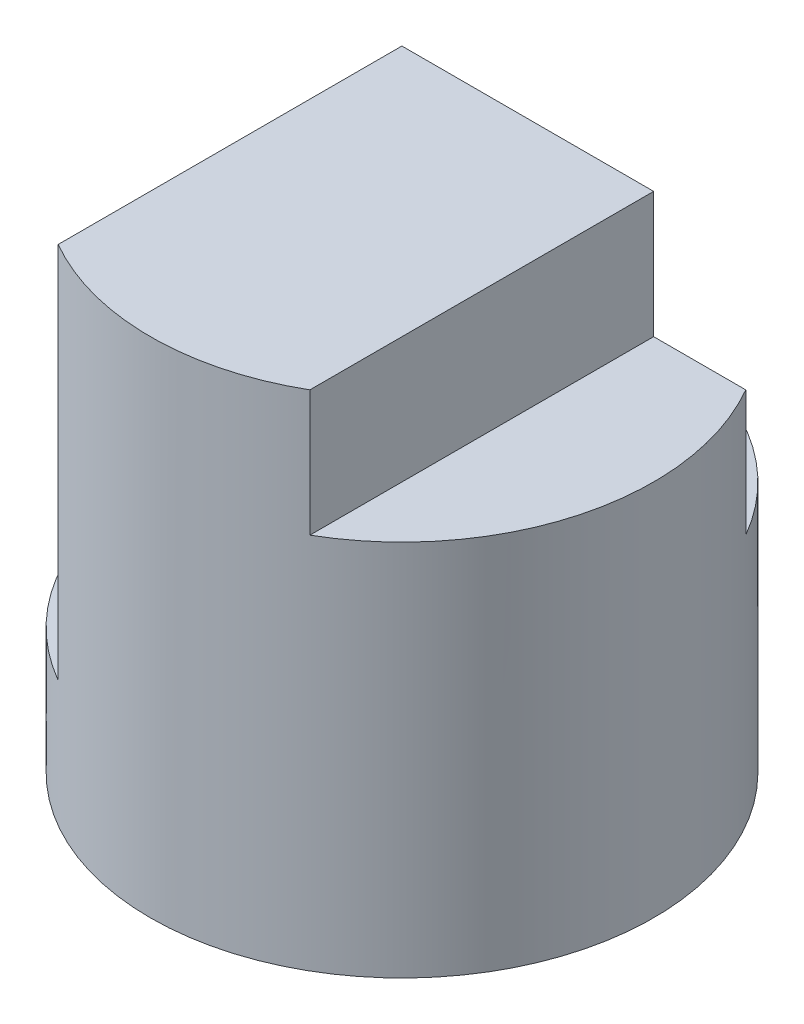
ISO-10303-21;
HEADER;
FILE_DESCRIPTION(('STEP AP214'),'2;1');
FILE_NAME('part.step','',(''),(''),'','','');
FILE_SCHEMA(('AUTOMOTIVE_DESIGN { 1 0 10303 214 1 1 1 1 }'));
ENDSEC;
DATA;
#1=APPLICATION_CONTEXT('core data for automotive mechanical design processes');
#2=APPLICATION_PROTOCOL_DEFINITION('international standard','automotive_design',2000,#1);
#3=PRODUCT_CONTEXT('',#1,'mechanical');
#4=PRODUCT('Part','Part','',(#3));
#5=PRODUCT_RELATED_PRODUCT_CATEGORY('part','',(#4));
#6=PRODUCT_DEFINITION_FORMATION('','',#4);
#7=PRODUCT_DEFINITION_CONTEXT('part definition',#1,'design');
#8=PRODUCT_DEFINITION('design','',#6,#7);
#9=PRODUCT_DEFINITION_SHAPE('','',#8);
#10=(LENGTH_UNIT() NAMED_UNIT(*) SI_UNIT(.MILLI.,.METRE.));
#11=(NAMED_UNIT(*) PLANE_ANGLE_UNIT() SI_UNIT($,.RADIAN.));
#12=(NAMED_UNIT(*) SI_UNIT($,.STERADIAN.) SOLID_ANGLE_UNIT());
#13=UNCERTAINTY_MEASURE_WITH_UNIT(LENGTH_MEASURE(1.E-05),#10,'distance_accuracy_value','');
#14=(GEOMETRIC_REPRESENTATION_CONTEXT(3) GLOBAL_UNCERTAINTY_ASSIGNED_CONTEXT((#13)) GLOBAL_UNIT_ASSIGNED_CONTEXT((#10,
#11,#12)) REPRESENTATION_CONTEXT('',''));
#15=CARTESIAN_POINT('',(0.,0.,0.));
#16=DIRECTION('',(0.,0.,1.));
#17=DIRECTION('',(1.,0.,0.));
#18=AXIS2_PLACEMENT_3D('',#15,#16,#17);
#19=CARTESIAN_POINT('',(0.,4.,0.));
#20=DIRECTION('',(0.,-1.,0.));
#21=DIRECTION('',(0.,0.,-1.));
#22=AXIS2_PLACEMENT_3D('',#19,#20,#21);
#23=CYLINDRICAL_SURFACE('',#22,2.);
#24=CARTESIAN_POINT('',(0.,0.,0.));
#25=DIRECTION('',(0.,1.,0.));
#26=DIRECTION('',(0.,0.,1.));
#27=AXIS2_PLACEMENT_3D('',#24,#25,#26);
#28=CIRCLE('',#27,2.);
#29=CARTESIAN_POINT('',(0.,0.,2.));
#30=VERTEX_POINT('',#29);
#31=EDGE_CURVE('E126',#30,#30,#28,.T.);
#32=ORIENTED_EDGE('',*,*,#31,.T.);
#33=EDGE_LOOP('',(#32));
#34=FACE_BOUND('',#33,.T.);
#35=DIRECTION('',(0.,-1.,0.));
#36=VECTOR('',#35,1.);
#37=CARTESIAN_POINT('',(-1.00088278766461,4.,1.73154082982664));
#38=LINE('',#37,#36);
#39=CARTESIAN_POINT('',(-1.00088278766461,4.,1.73154082982664));
#40=VERTEX_POINT('',#39);
#41=CARTESIAN_POINT('',(-1.00088278766461,1.,1.73154082982664));
#42=VERTEX_POINT('',#41);
#43=EDGE_CURVE('E47',#40,#42,#38,.T.);
#44=ORIENTED_EDGE('',*,*,#43,.T.);
#45=CARTESIAN_POINT('',(0.,1.,0.));
#46=DIRECTION('',(0.,1.,0.));
#47=DIRECTION('',(0.,0.,1.));
#48=AXIS2_PLACEMENT_3D('',#45,#46,#47);
#49=CIRCLE('',#48,2.);
#50=CARTESIAN_POINT('',(-1.73205080756888,1.,-1.));
#51=VERTEX_POINT('',#50);
#52=EDGE_CURVE('E11',#51,#42,#49,.T.);
#53=ORIENTED_EDGE('',*,*,#52,.F.);
#54=DIRECTION('',(0.,-1.,0.));
#55=VECTOR('',#54,1.);
#56=CARTESIAN_POINT('',(-1.73205080756888,4.,-1.));
#57=LINE('',#56,#55);
#58=CARTESIAN_POINT('',(-1.73205080756888,2.,-1.));
#59=VERTEX_POINT('',#58);
#60=EDGE_CURVE('E142',#51,#59,#57,.F.);
#61=ORIENTED_EDGE('',*,*,#60,.T.);
#62=CARTESIAN_POINT('',(0.,2.,0.));
#63=DIRECTION('',(0.,-1.,0.));
#64=DIRECTION('',(0.,0.,-1.));
#65=AXIS2_PLACEMENT_3D('',#62,#63,#64);
#66=CIRCLE('',#65,2.);
#67=CARTESIAN_POINT('',(1.73205080756888,2.,-1.));
#68=VERTEX_POINT('',#67);
#69=EDGE_CURVE('E107',#59,#68,#66,.T.);
#70=ORIENTED_EDGE('',*,*,#69,.T.);
#71=DIRECTION('',(0.,1.,0.));
#72=VECTOR('',#71,1.);
#73=CARTESIAN_POINT('',(1.73205080756888,2.,-1.));
#74=LINE('',#73,#72);
#75=CARTESIAN_POINT('',(1.73205080756888,3.,-1.));
#76=VERTEX_POINT('',#75);
#77=EDGE_CURVE('E113',#68,#76,#74,.T.);
#78=ORIENTED_EDGE('',*,*,#77,.T.);
#79=CARTESIAN_POINT('',(0.,3.,0.));
#80=DIRECTION('',(0.,1.,0.));
#81=DIRECTION('',(0.,0.,1.));
#82=AXIS2_PLACEMENT_3D('',#79,#80,#81);
#83=CIRCLE('',#82,2.);
#84=CARTESIAN_POINT('',(1.,3.,1.73205080756888));
#85=VERTEX_POINT('',#84);
#86=EDGE_CURVE('E118',#85,#76,#83,.T.);
#87=ORIENTED_EDGE('',*,*,#86,.F.);
#88=DIRECTION('',(0.,-1.,0.));
#89=VECTOR('',#88,1.);
#90=CARTESIAN_POINT('',(1.,4.,1.73205080756888));
#91=LINE('',#90,#89);
#92=CARTESIAN_POINT('',(1.,4.,1.73205080756888));
#93=VERTEX_POINT('',#92);
#94=EDGE_CURVE('E132',#85,#93,#91,.F.);
#95=ORIENTED_EDGE('',*,*,#94,.T.);
#96=CARTESIAN_POINT('',(0.,4.,0.));
#97=DIRECTION('',(0.,1.,0.));
#98=DIRECTION('',(0.,0.,1.));
#99=AXIS2_PLACEMENT_3D('',#96,#97,#98);
#100=CIRCLE('',#99,2.);
#101=EDGE_CURVE('E125',#40,#93,#100,.T.);
#102=ORIENTED_EDGE('',*,*,#101,.F.);
#103=EDGE_LOOP('',(#44,#53,#61,#70,#78,#87,#95,#102));
#104=FACE_BOUND('',#103,.T.);
#105=ADVANCED_FACE('F33',(#34,#104),#23,.T.);
#106=CARTESIAN_POINT('',(0.,4.,0.));
#107=DIRECTION('',(0.,1.,0.));
#108=DIRECTION('',(0.,0.,1.));
#109=AXIS2_PLACEMENT_3D('',#106,#107,#108);
#110=PLANE('',#109);
#111=DIRECTION('',(1.,0.,0.));
#112=VECTOR('',#111,1.);
#113=CARTESIAN_POINT('',(-1.73205080756888,4.,-1.));
#114=LINE('',#113,#112);
#115=CARTESIAN_POINT('',(-1.00088278766461,4.,-1.));
#116=VERTEX_POINT('',#115);
#117=CARTESIAN_POINT('',(0.999999999999999,4.,-1.));
#118=VERTEX_POINT('',#117);
#119=EDGE_CURVE('E114',#116,#118,#114,.T.);
#120=ORIENTED_EDGE('',*,*,#119,.F.);
#121=DIRECTION('',(0.,0.,-1.));
#122=VECTOR('',#121,1.);
#123=CARTESIAN_POINT('',(-1.00088278766461,4.,0.));
#124=LINE('',#123,#122);
#125=EDGE_CURVE('E117',#40,#116,#124,.T.);
#126=ORIENTED_EDGE('',*,*,#125,.F.);
#127=ORIENTED_EDGE('',*,*,#101,.T.);
#128=DIRECTION('',(0.,0.,1.));
#129=VECTOR('',#128,1.);
#130=CARTESIAN_POINT('',(1.,4.,0.));
#131=LINE('',#130,#129);
#132=EDGE_CURVE('E123',#118,#93,#131,.T.);
#133=ORIENTED_EDGE('',*,*,#132,.F.);
#134=EDGE_LOOP('',(#120,#126,#127,#133));
#135=FACE_BOUND('',#134,.T.);
#136=ADVANCED_FACE('F155',(#135),#110,.T.);
#137=CARTESIAN_POINT('',(0.,0.,0.));
#138=DIRECTION('',(0.,1.,0.));
#139=DIRECTION('',(0.,0.,1.));
#140=AXIS2_PLACEMENT_3D('',#137,#138,#139);
#141=PLANE('',#140);
#142=ORIENTED_EDGE('',*,*,#31,.F.);
#143=EDGE_LOOP('',(#142));
#144=FACE_BOUND('',#143,.T.);
#145=ADVANCED_FACE('F160',(#144),#141,.F.);
#146=CARTESIAN_POINT('',(0.,3.,-2.));
#147=DIRECTION('',(0.,1.,0.));
#148=DIRECTION('',(0.,0.,1.));
#149=AXIS2_PLACEMENT_3D('',#146,#147,#148);
#150=PLANE('',#149);
#151=DIRECTION('',(1.,0.,0.));
#152=VECTOR('',#151,1.);
#153=CARTESIAN_POINT('',(0.,3.,-1.));
#154=LINE('',#153,#152);
#155=CARTESIAN_POINT('',(1.,3.,-1.));
#156=VERTEX_POINT('',#155);
#157=EDGE_CURVE('E136',#156,#76,#154,.T.);
#158=ORIENTED_EDGE('',*,*,#157,.F.);
#159=DIRECTION('',(0.,0.,1.));
#160=VECTOR('',#159,1.);
#161=CARTESIAN_POINT('',(1.,3.,-2.));
#162=LINE('',#161,#160);
#163=EDGE_CURVE('E55',#156,#85,#162,.T.);
#164=ORIENTED_EDGE('',*,*,#163,.T.);
#165=ORIENTED_EDGE('',*,*,#86,.T.);
#166=EDGE_LOOP('',(#158,#164,#165));
#167=FACE_BOUND('',#166,.T.);
#168=ADVANCED_FACE('F158',(#167),#150,.T.);
#169=CARTESIAN_POINT('',(1.,0.,-2.));
#170=DIRECTION('',(-1.,0.,0.));
#171=DIRECTION('',(0.,0.,1.));
#172=AXIS2_PLACEMENT_3D('',#169,#170,#171);
#173=PLANE('',#172);
#174=ORIENTED_EDGE('',*,*,#163,.F.);
#175=DIRECTION('',(0.,1.,0.));
#176=VECTOR('',#175,1.);
#177=CARTESIAN_POINT('',(1.,0.,-1.));
#178=LINE('',#177,#176);
#179=EDGE_CURVE('E138',#156,#118,#178,.T.);
#180=ORIENTED_EDGE('',*,*,#179,.T.);
#181=ORIENTED_EDGE('',*,*,#132,.T.);
#182=ORIENTED_EDGE('',*,*,#94,.F.);
#183=EDGE_LOOP('',(#174,#180,#181,#182));
#184=FACE_BOUND('',#183,.T.);
#185=ADVANCED_FACE('F157',(#184),#173,.F.);
#186=CARTESIAN_POINT('',(0.,2.,-2.));
#187=DIRECTION('',(0.,-1.,0.));
#188=DIRECTION('',(0.,0.,-1.));
#189=AXIS2_PLACEMENT_3D('',#186,#187,#188);
#190=PLANE('',#189);
#191=ORIENTED_EDGE('',*,*,#69,.F.);
#192=DIRECTION('',(-1.,0.,0.));
#193=VECTOR('',#192,1.);
#194=CARTESIAN_POINT('',(-1.00088278766461,2.,-1.));
#195=LINE('',#194,#193);
#196=CARTESIAN_POINT('',(-1.00088278766461,2.,-1.));
#197=VERTEX_POINT('',#196);
#198=EDGE_CURVE('E94',#197,#59,#195,.T.);
#199=ORIENTED_EDGE('',*,*,#198,.F.);
#200=DIRECTION('',(1.,0.,0.));
#201=VECTOR('',#200,1.);
#202=CARTESIAN_POINT('',(-1.73205080756888,2.,-1.));
#203=LINE('',#202,#201);
#204=EDGE_CURVE('E105',#197,#68,#203,.T.);
#205=ORIENTED_EDGE('',*,*,#204,.T.);
#206=EDGE_LOOP('',(#191,#199,#205));
#207=FACE_BOUND('',#206,.T.);
#208=ADVANCED_FACE('F104',(#207),#190,.F.);
#209=CARTESIAN_POINT('',(-1.00088278766461,0.,-2.));
#210=DIRECTION('',(1.,0.,0.));
#211=DIRECTION('',(0.,0.,-1.));
#212=AXIS2_PLACEMENT_3D('',#209,#210,#211);
#213=PLANE('',#212);
#214=ORIENTED_EDGE('',*,*,#125,.T.);
#215=DIRECTION('',(0.,-1.,0.));
#216=VECTOR('',#215,1.);
#217=CARTESIAN_POINT('',(-1.00088278766461,0.,-1.));
#218=LINE('',#217,#216);
#219=EDGE_CURVE('E40',#116,#197,#218,.T.);
#220=ORIENTED_EDGE('',*,*,#219,.T.);
#221=DIRECTION('',(0.,1.,0.));
#222=VECTOR('',#221,1.);
#223=CARTESIAN_POINT('',(-1.00088278766461,2.,-1.));
#224=LINE('',#223,#222);
#225=CARTESIAN_POINT('',(-1.00088278766461,1.,-1.));
#226=VERTEX_POINT('',#225);
#227=EDGE_CURVE('E91',#226,#197,#224,.T.);
#228=ORIENTED_EDGE('',*,*,#227,.F.);
#229=DIRECTION('',(0.,0.,-1.));
#230=VECTOR('',#229,1.);
#231=CARTESIAN_POINT('',(-1.00088278766461,1.,2.));
#232=LINE('',#231,#230);
#233=EDGE_CURVE('E145',#42,#226,#232,.T.);
#234=ORIENTED_EDGE('',*,*,#233,.F.);
#235=ORIENTED_EDGE('',*,*,#43,.F.);
#236=EDGE_LOOP('',(#214,#220,#228,#234,#235));
#237=FACE_BOUND('',#236,.T.);
#238=ADVANCED_FACE('F116',(#237),#213,.F.);
#239=CARTESIAN_POINT('',(-1.73205080756888,2.,-1.));
#240=DIRECTION('',(0.,0.,1.));
#241=DIRECTION('',(1.,0.,0.));
#242=AXIS2_PLACEMENT_3D('',#239,#240,#241);
#243=PLANE('',#242);
#244=ORIENTED_EDGE('',*,*,#157,.T.);
#245=ORIENTED_EDGE('',*,*,#77,.F.);
#246=ORIENTED_EDGE('',*,*,#204,.F.);
#247=ORIENTED_EDGE('',*,*,#219,.F.);
#248=ORIENTED_EDGE('',*,*,#119,.T.);
#249=ORIENTED_EDGE('',*,*,#179,.F.);
#250=EDGE_LOOP('',(#244,#245,#246,#247,#248,#249));
#251=FACE_BOUND('',#250,.T.);
#252=ADVANCED_FACE('F110',(#251),#243,.F.);
#253=CARTESIAN_POINT('',(-1.00088278766461,1.,2.));
#254=DIRECTION('',(0.,1.,0.));
#255=DIRECTION('',(0.,0.,1.));
#256=AXIS2_PLACEMENT_3D('',#253,#254,#255);
#257=PLANE('',#256);
#258=ORIENTED_EDGE('',*,*,#52,.T.);
#259=ORIENTED_EDGE('',*,*,#233,.T.);
#260=DIRECTION('',(1.,0.,0.));
#261=VECTOR('',#260,1.);
#262=CARTESIAN_POINT('',(-1.00088278766461,1.,-1.));
#263=LINE('',#262,#261);
#264=EDGE_CURVE('E97',#51,#226,#263,.T.);
#265=ORIENTED_EDGE('',*,*,#264,.F.);
#266=EDGE_LOOP('',(#258,#259,#265));
#267=FACE_BOUND('',#266,.T.);
#268=ADVANCED_FACE('F148',(#267),#257,.T.);
#269=CARTESIAN_POINT('',(0.,0.,-1.));
#270=DIRECTION('',(0.,0.,-1.));
#271=DIRECTION('',(-1.,0.,0.));
#272=AXIS2_PLACEMENT_3D('',#269,#270,#271);
#273=PLANE('',#272);
#274=ORIENTED_EDGE('',*,*,#264,.T.);
#275=ORIENTED_EDGE('',*,*,#227,.T.);
#276=ORIENTED_EDGE('',*,*,#198,.T.);
#277=ORIENTED_EDGE('',*,*,#60,.F.);
#278=EDGE_LOOP('',(#274,#275,#276,#277));
#279=FACE_BOUND('',#278,.T.);
#280=ADVANCED_FACE('F93',(#279),#273,.F.);
#281=CLOSED_SHELL('',(#105,#136,#145,#168,#185,#208,#238,#252,#268,#280));
#282=MANIFOLD_SOLID_BREP('B2',#281);
#283=ADVANCED_BREP_SHAPE_REPRESENTATION('',(#18,#282),#14);
#284=SHAPE_DEFINITION_REPRESENTATION(#9,#283);
ENDSEC;
END-ISO-10303-21;
